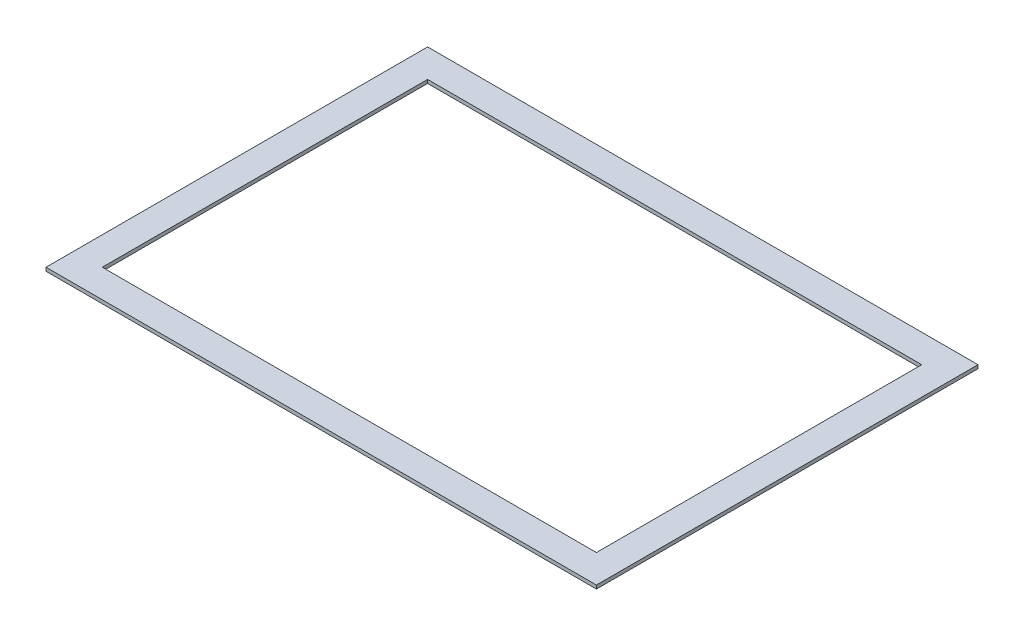
ISO-10303-21;
HEADER;
FILE_DESCRIPTION(('STEP AP214'),'2;1');
FILE_NAME('part.step','',(''),(''),'','','');
FILE_SCHEMA(('AUTOMOTIVE_DESIGN { 1 0 10303 214 1 1 1 1 }'));
ENDSEC;
DATA;
#1=APPLICATION_CONTEXT('core data for automotive mechanical design processes');
#2=APPLICATION_PROTOCOL_DEFINITION('international standard','automotive_design',2000,#1);
#3=PRODUCT_CONTEXT('',#1,'mechanical');
#4=PRODUCT('Part','Part','',(#3));
#5=PRODUCT_RELATED_PRODUCT_CATEGORY('part','',(#4));
#6=PRODUCT_DEFINITION_FORMATION('','',#4);
#7=PRODUCT_DEFINITION_CONTEXT('part definition',#1,'design');
#8=PRODUCT_DEFINITION('design','',#6,#7);
#9=PRODUCT_DEFINITION_SHAPE('','',#8);
#10=(LENGTH_UNIT() NAMED_UNIT(*) SI_UNIT(.MILLI.,.METRE.));
#11=(NAMED_UNIT(*) PLANE_ANGLE_UNIT() SI_UNIT($,.RADIAN.));
#12=(NAMED_UNIT(*) SI_UNIT($,.STERADIAN.) SOLID_ANGLE_UNIT());
#13=UNCERTAINTY_MEASURE_WITH_UNIT(LENGTH_MEASURE(1.E-05),#10,'distance_accuracy_value','');
#14=(GEOMETRIC_REPRESENTATION_CONTEXT(3) GLOBAL_UNCERTAINTY_ASSIGNED_CONTEXT((#13)) GLOBAL_UNIT_ASSIGNED_CONTEXT((#10,
#11,#12)) REPRESENTATION_CONTEXT('',''));
#15=CARTESIAN_POINT('',(0.,0.,0.));
#16=DIRECTION('',(0.,0.,1.));
#17=DIRECTION('',(1.,0.,0.));
#18=AXIS2_PLACEMENT_3D('',#15,#16,#17);
#19=CARTESIAN_POINT('',(0.,3.175,0.));
#20=DIRECTION('',(0.,-1.,0.));
#21=DIRECTION('',(0.,0.,-1.));
#22=AXIS2_PLACEMENT_3D('',#19,#20,#21);
#23=PLANE('',#22);
#24=DIRECTION('',(0.,0.,-1.));
#25=VECTOR('',#24,1.);
#26=CARTESIAN_POINT('',(248.44375,3.175,172.24375));
#27=LINE('',#26,#25);
#28=CARTESIAN_POINT('',(248.44375,3.175,172.24375));
#29=VERTEX_POINT('',#28);
#30=CARTESIAN_POINT('',(248.44375,3.175,-172.24375));
#31=VERTEX_POINT('',#30);
#32=EDGE_CURVE('E161',#29,#31,#27,.T.);
#33=ORIENTED_EDGE('',*,*,#32,.T.);
#34=DIRECTION('',(-1.,0.,0.));
#35=VECTOR('',#34,1.);
#36=CARTESIAN_POINT('',(-248.44375,3.175,-172.24375));
#37=LINE('',#36,#35);
#38=CARTESIAN_POINT('',(-248.44375,3.175,-172.24375));
#39=VERTEX_POINT('',#38);
#40=EDGE_CURVE('E165',#31,#39,#37,.T.);
#41=ORIENTED_EDGE('',*,*,#40,.T.);
#42=DIRECTION('',(0.,0.,1.));
#43=VECTOR('',#42,1.);
#44=CARTESIAN_POINT('',(-248.44375,3.175,172.24375));
#45=LINE('',#44,#43);
#46=CARTESIAN_POINT('',(-248.44375,3.175,172.24375));
#47=VERTEX_POINT('',#46);
#48=EDGE_CURVE('E169',#39,#47,#45,.T.);
#49=ORIENTED_EDGE('',*,*,#48,.T.);
#50=DIRECTION('',(1.,0.,0.));
#51=VECTOR('',#50,1.);
#52=CARTESIAN_POINT('',(-248.44375,3.175,172.24375));
#53=LINE('',#52,#51);
#54=EDGE_CURVE('E172',#47,#29,#53,.T.);
#55=ORIENTED_EDGE('',*,*,#54,.T.);
#56=EDGE_LOOP('',(#33,#41,#49,#55));
#57=FACE_BOUND('',#56,.T.);
#58=DIRECTION('',(0.,0.,1.));
#59=VECTOR('',#58,1.);
#60=CARTESIAN_POINT('',(-223.04375,3.175,146.84375));
#61=LINE('',#60,#59);
#62=CARTESIAN_POINT('',(-223.04375,3.175,-146.84375));
#63=VERTEX_POINT('',#62);
#64=CARTESIAN_POINT('',(-223.04375,3.175,146.84375));
#65=VERTEX_POINT('',#64);
#66=EDGE_CURVE('E113',#63,#65,#61,.T.);
#67=ORIENTED_EDGE('',*,*,#66,.F.);
#68=DIRECTION('',(-1.,0.,0.));
#69=VECTOR('',#68,1.);
#70=CARTESIAN_POINT('',(-223.04375,3.175,-146.84375));
#71=LINE('',#70,#69);
#72=CARTESIAN_POINT('',(223.04375,3.175,-146.84375));
#73=VERTEX_POINT('',#72);
#74=EDGE_CURVE('E139',#73,#63,#71,.T.);
#75=ORIENTED_EDGE('',*,*,#74,.F.);
#76=DIRECTION('',(0.,0.,-1.));
#77=VECTOR('',#76,1.);
#78=CARTESIAN_POINT('',(223.04375,3.175,146.84375));
#79=LINE('',#78,#77);
#80=CARTESIAN_POINT('',(223.04375,3.175,146.84375));
#81=VERTEX_POINT('',#80);
#82=EDGE_CURVE('E135',#81,#73,#79,.T.);
#83=ORIENTED_EDGE('',*,*,#82,.F.);
#84=DIRECTION('',(1.,0.,0.));
#85=VECTOR('',#84,1.);
#86=CARTESIAN_POINT('',(-223.04375,3.175,146.84375));
#87=LINE('',#86,#85);
#88=EDGE_CURVE('E122',#65,#81,#87,.T.);
#89=ORIENTED_EDGE('',*,*,#88,.F.);
#90=EDGE_LOOP('',(#67,#75,#83,#89));
#91=FACE_BOUND('',#90,.T.);
#92=ADVANCED_FACE('F47',(#57,#91),#23,.F.);
#93=CARTESIAN_POINT('',(0.,0.,0.));
#94=DIRECTION('',(0.,-1.,0.));
#95=DIRECTION('',(0.,0.,-1.));
#96=AXIS2_PLACEMENT_3D('',#93,#94,#95);
#97=PLANE('',#96);
#98=DIRECTION('',(0.,0.,-1.));
#99=VECTOR('',#98,1.);
#100=CARTESIAN_POINT('',(248.44375,0.,172.24375));
#101=LINE('',#100,#99);
#102=CARTESIAN_POINT('',(248.44375,0.,172.24375));
#103=VERTEX_POINT('',#102);
#104=CARTESIAN_POINT('',(248.44375,0.,-172.24375));
#105=VERTEX_POINT('',#104);
#106=EDGE_CURVE('E131',#103,#105,#101,.T.);
#107=ORIENTED_EDGE('',*,*,#106,.F.);
#108=DIRECTION('',(1.,0.,0.));
#109=VECTOR('',#108,1.);
#110=CARTESIAN_POINT('',(-248.44375,0.,172.24375));
#111=LINE('',#110,#109);
#112=CARTESIAN_POINT('',(-248.44375,0.,172.24375));
#113=VERTEX_POINT('',#112);
#114=EDGE_CURVE('E166',#113,#103,#111,.T.);
#115=ORIENTED_EDGE('',*,*,#114,.F.);
#116=DIRECTION('',(0.,0.,1.));
#117=VECTOR('',#116,1.);
#118=CARTESIAN_POINT('',(-248.44375,0.,172.24375));
#119=LINE('',#118,#117);
#120=CARTESIAN_POINT('',(-248.44375,0.,-172.24375));
#121=VERTEX_POINT('',#120);
#122=EDGE_CURVE('E182',#121,#113,#119,.T.);
#123=ORIENTED_EDGE('',*,*,#122,.F.);
#124=DIRECTION('',(-1.,0.,0.));
#125=VECTOR('',#124,1.);
#126=CARTESIAN_POINT('',(-248.44375,0.,-172.24375));
#127=LINE('',#126,#125);
#128=EDGE_CURVE('E179',#105,#121,#127,.T.);
#129=ORIENTED_EDGE('',*,*,#128,.F.);
#130=EDGE_LOOP('',(#107,#115,#123,#129));
#131=FACE_BOUND('',#130,.T.);
#132=DIRECTION('',(-1.,0.,0.));
#133=VECTOR('',#132,1.);
#134=CARTESIAN_POINT('',(-223.04375,0.,-146.84375));
#135=LINE('',#134,#133);
#136=CARTESIAN_POINT('',(223.04375,0.,-146.84375));
#137=VERTEX_POINT('',#136);
#138=CARTESIAN_POINT('',(-223.04375,0.,-146.84375));
#139=VERTEX_POINT('',#138);
#140=EDGE_CURVE('E123',#137,#139,#135,.T.);
#141=ORIENTED_EDGE('',*,*,#140,.T.);
#142=DIRECTION('',(0.,0.,1.));
#143=VECTOR('',#142,1.);
#144=CARTESIAN_POINT('',(-223.04375,0.,146.84375));
#145=LINE('',#144,#143);
#146=CARTESIAN_POINT('',(-223.04375,0.,146.84375));
#147=VERTEX_POINT('',#146);
#148=EDGE_CURVE('E71',#139,#147,#145,.T.);
#149=ORIENTED_EDGE('',*,*,#148,.T.);
#150=DIRECTION('',(1.,0.,0.));
#151=VECTOR('',#150,1.);
#152=CARTESIAN_POINT('',(-223.04375,0.,146.84375));
#153=LINE('',#152,#151);
#154=CARTESIAN_POINT('',(223.04375,0.,146.84375));
#155=VERTEX_POINT('',#154);
#156=EDGE_CURVE('E129',#147,#155,#153,.T.);
#157=ORIENTED_EDGE('',*,*,#156,.T.);
#158=DIRECTION('',(0.,0.,-1.));
#159=VECTOR('',#158,1.);
#160=CARTESIAN_POINT('',(223.04375,0.,146.84375));
#161=LINE('',#160,#159);
#162=EDGE_CURVE('E148',#155,#137,#161,.T.);
#163=ORIENTED_EDGE('',*,*,#162,.T.);
#164=EDGE_LOOP('',(#141,#149,#157,#163));
#165=FACE_BOUND('',#164,.T.);
#166=ADVANCED_FACE('F205',(#131,#165),#97,.T.);
#167=CARTESIAN_POINT('',(248.44375,3.175,172.24375));
#168=DIRECTION('',(-1.,0.,0.));
#169=DIRECTION('',(0.,0.,1.));
#170=AXIS2_PLACEMENT_3D('',#167,#168,#169);
#171=PLANE('',#170);
#172=ORIENTED_EDGE('',*,*,#106,.T.);
#173=DIRECTION('',(0.,-1.,0.));
#174=VECTOR('',#173,1.);
#175=CARTESIAN_POINT('',(248.44375,3.175,-172.24375));
#176=LINE('',#175,#174);
#177=EDGE_CURVE('E11',#31,#105,#176,.T.);
#178=ORIENTED_EDGE('',*,*,#177,.F.);
#179=ORIENTED_EDGE('',*,*,#32,.F.);
#180=DIRECTION('',(0.,-1.,0.));
#181=VECTOR('',#180,1.);
#182=CARTESIAN_POINT('',(248.44375,3.175,172.24375));
#183=LINE('',#182,#181);
#184=EDGE_CURVE('E175',#29,#103,#183,.T.);
#185=ORIENTED_EDGE('',*,*,#184,.T.);
#186=EDGE_LOOP('',(#172,#178,#179,#185));
#187=FACE_BOUND('',#186,.T.);
#188=ADVANCED_FACE('F49',(#187),#171,.F.);
#189=CARTESIAN_POINT('',(-248.44375,3.175,-172.24375));
#190=DIRECTION('',(0.,0.,1.));
#191=DIRECTION('',(1.,0.,0.));
#192=AXIS2_PLACEMENT_3D('',#189,#190,#191);
#193=PLANE('',#192);
#194=ORIENTED_EDGE('',*,*,#128,.T.);
#195=DIRECTION('',(0.,-1.,0.));
#196=VECTOR('',#195,1.);
#197=CARTESIAN_POINT('',(-248.44375,3.175,-172.24375));
#198=LINE('',#197,#196);
#199=EDGE_CURVE('E56',#39,#121,#198,.T.);
#200=ORIENTED_EDGE('',*,*,#199,.F.);
#201=ORIENTED_EDGE('',*,*,#40,.F.);
#202=ORIENTED_EDGE('',*,*,#177,.T.);
#203=EDGE_LOOP('',(#194,#200,#201,#202));
#204=FACE_BOUND('',#203,.T.);
#205=ADVANCED_FACE('F215',(#204),#193,.F.);
#206=CARTESIAN_POINT('',(-248.44375,3.175,172.24375));
#207=DIRECTION('',(1.,0.,0.));
#208=DIRECTION('',(0.,0.,-1.));
#209=AXIS2_PLACEMENT_3D('',#206,#207,#208);
#210=PLANE('',#209);
#211=ORIENTED_EDGE('',*,*,#122,.T.);
#212=DIRECTION('',(0.,-1.,0.));
#213=VECTOR('',#212,1.);
#214=CARTESIAN_POINT('',(-248.44375,3.175,172.24375));
#215=LINE('',#214,#213);
#216=EDGE_CURVE('E190',#47,#113,#215,.T.);
#217=ORIENTED_EDGE('',*,*,#216,.F.);
#218=ORIENTED_EDGE('',*,*,#48,.F.);
#219=ORIENTED_EDGE('',*,*,#199,.T.);
#220=EDGE_LOOP('',(#211,#217,#218,#219));
#221=FACE_BOUND('',#220,.T.);
#222=ADVANCED_FACE('F199',(#221),#210,.F.);
#223=CARTESIAN_POINT('',(-248.44375,3.175,172.24375));
#224=DIRECTION('',(0.,0.,-1.));
#225=DIRECTION('',(-1.,0.,0.));
#226=AXIS2_PLACEMENT_3D('',#223,#224,#225);
#227=PLANE('',#226);
#228=ORIENTED_EDGE('',*,*,#114,.T.);
#229=ORIENTED_EDGE('',*,*,#184,.F.);
#230=ORIENTED_EDGE('',*,*,#54,.F.);
#231=ORIENTED_EDGE('',*,*,#216,.T.);
#232=EDGE_LOOP('',(#228,#229,#230,#231));
#233=FACE_BOUND('',#232,.T.);
#234=ADVANCED_FACE('F209',(#233),#227,.F.);
#235=CARTESIAN_POINT('',(-223.04375,3.175,146.84375));
#236=DIRECTION('',(1.,0.,0.));
#237=DIRECTION('',(0.,0.,-1.));
#238=AXIS2_PLACEMENT_3D('',#235,#236,#237);
#239=PLANE('',#238);
#240=ORIENTED_EDGE('',*,*,#148,.F.);
#241=DIRECTION('',(0.,-1.,0.));
#242=VECTOR('',#241,1.);
#243=CARTESIAN_POINT('',(-223.04375,3.175,-146.84375));
#244=LINE('',#243,#242);
#245=EDGE_CURVE('E117',#63,#139,#244,.T.);
#246=ORIENTED_EDGE('',*,*,#245,.F.);
#247=ORIENTED_EDGE('',*,*,#66,.T.);
#248=DIRECTION('',(0.,-1.,0.));
#249=VECTOR('',#248,1.);
#250=CARTESIAN_POINT('',(-223.04375,3.175,146.84375));
#251=LINE('',#250,#249);
#252=EDGE_CURVE('E116',#65,#147,#251,.T.);
#253=ORIENTED_EDGE('',*,*,#252,.T.);
#254=EDGE_LOOP('',(#240,#246,#247,#253));
#255=FACE_BOUND('',#254,.T.);
#256=ADVANCED_FACE('F115',(#255),#239,.T.);
#257=CARTESIAN_POINT('',(-223.04375,3.175,146.84375));
#258=DIRECTION('',(0.,0.,-1.));
#259=DIRECTION('',(-1.,0.,0.));
#260=AXIS2_PLACEMENT_3D('',#257,#258,#259);
#261=PLANE('',#260);
#262=ORIENTED_EDGE('',*,*,#156,.F.);
#263=ORIENTED_EDGE('',*,*,#252,.F.);
#264=ORIENTED_EDGE('',*,*,#88,.T.);
#265=DIRECTION('',(0.,-1.,0.));
#266=VECTOR('',#265,1.);
#267=CARTESIAN_POINT('',(223.04375,3.175,146.84375));
#268=LINE('',#267,#266);
#269=EDGE_CURVE('E132',#81,#155,#268,.T.);
#270=ORIENTED_EDGE('',*,*,#269,.T.);
#271=EDGE_LOOP('',(#262,#263,#264,#270));
#272=FACE_BOUND('',#271,.T.);
#273=ADVANCED_FACE('F126',(#272),#261,.T.);
#274=CARTESIAN_POINT('',(223.04375,3.175,146.84375));
#275=DIRECTION('',(-1.,0.,0.));
#276=DIRECTION('',(0.,0.,1.));
#277=AXIS2_PLACEMENT_3D('',#274,#275,#276);
#278=PLANE('',#277);
#279=ORIENTED_EDGE('',*,*,#162,.F.);
#280=ORIENTED_EDGE('',*,*,#269,.F.);
#281=ORIENTED_EDGE('',*,*,#82,.T.);
#282=DIRECTION('',(0.,-1.,0.));
#283=VECTOR('',#282,1.);
#284=CARTESIAN_POINT('',(223.04375,3.175,-146.84375));
#285=LINE('',#284,#283);
#286=EDGE_CURVE('E63',#73,#137,#285,.T.);
#287=ORIENTED_EDGE('',*,*,#286,.T.);
#288=EDGE_LOOP('',(#279,#280,#281,#287));
#289=FACE_BOUND('',#288,.T.);
#290=ADVANCED_FACE('F238',(#289),#278,.T.);
#291=CARTESIAN_POINT('',(-223.04375,3.175,-146.84375));
#292=DIRECTION('',(0.,0.,1.));
#293=DIRECTION('',(1.,0.,0.));
#294=AXIS2_PLACEMENT_3D('',#291,#292,#293);
#295=PLANE('',#294);
#296=ORIENTED_EDGE('',*,*,#140,.F.);
#297=ORIENTED_EDGE('',*,*,#286,.F.);
#298=ORIENTED_EDGE('',*,*,#74,.T.);
#299=ORIENTED_EDGE('',*,*,#245,.T.);
#300=EDGE_LOOP('',(#296,#297,#298,#299));
#301=FACE_BOUND('',#300,.T.);
#302=ADVANCED_FACE('F242',(#301),#295,.T.);
#303=CLOSED_SHELL('',(#92,#166,#188,#205,#222,#234,#256,#273,#290,#302));
#304=MANIFOLD_SOLID_BREP('B2',#303);
#305=ADVANCED_BREP_SHAPE_REPRESENTATION('',(#18,#304),#14);
#306=SHAPE_DEFINITION_REPRESENTATION(#9,#305);
ENDSEC;
END-ISO-10303-21;
